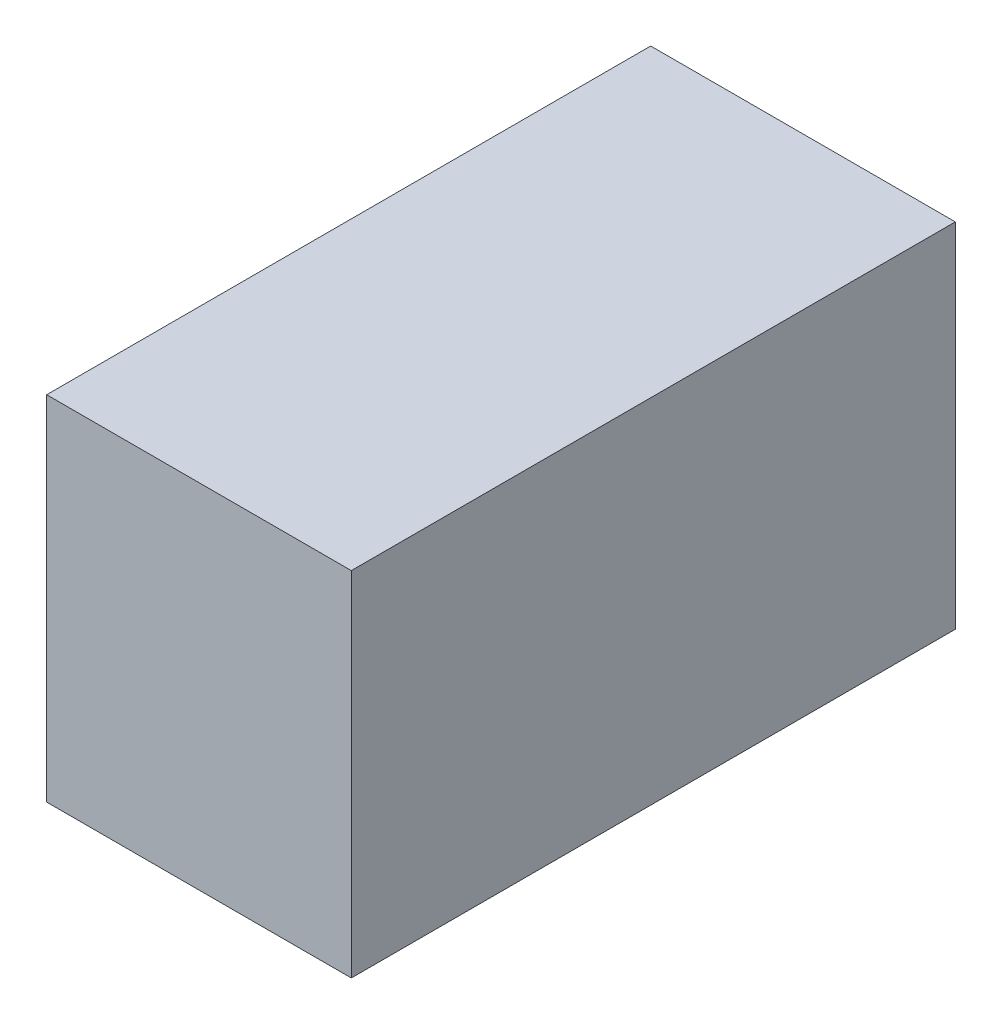
ISO-10303-21;
HEADER;
FILE_DESCRIPTION(('STEP AP214'),'2;1');
FILE_NAME('part.step','',(''),(''),'','','');
FILE_SCHEMA(('AUTOMOTIVE_DESIGN { 1 0 10303 214 1 1 1 1 }'));
ENDSEC;
DATA;
#1=APPLICATION_CONTEXT('core data for automotive mechanical design processes');
#2=APPLICATION_PROTOCOL_DEFINITION('international standard','automotive_design',2000,#1);
#3=PRODUCT_CONTEXT('',#1,'mechanical');
#4=PRODUCT('Part','Part','',(#3));
#5=PRODUCT_RELATED_PRODUCT_CATEGORY('part','',(#4));
#6=PRODUCT_DEFINITION_FORMATION('','',#4);
#7=PRODUCT_DEFINITION_CONTEXT('part definition',#1,'design');
#8=PRODUCT_DEFINITION('design','',#6,#7);
#9=PRODUCT_DEFINITION_SHAPE('','',#8);
#10=(LENGTH_UNIT() NAMED_UNIT(*) SI_UNIT(.MILLI.,.METRE.));
#11=(NAMED_UNIT(*) PLANE_ANGLE_UNIT() SI_UNIT($,.RADIAN.));
#12=(NAMED_UNIT(*) SI_UNIT($,.STERADIAN.) SOLID_ANGLE_UNIT());
#13=UNCERTAINTY_MEASURE_WITH_UNIT(LENGTH_MEASURE(1.E-05),#10,'distance_accuracy_value','');
#14=(GEOMETRIC_REPRESENTATION_CONTEXT(3) GLOBAL_UNCERTAINTY_ASSIGNED_CONTEXT((#13)) GLOBAL_UNIT_ASSIGNED_CONTEXT((#10,
#11,#12)) REPRESENTATION_CONTEXT('',''));
#15=CARTESIAN_POINT('',(0.,0.,0.));
#16=DIRECTION('',(0.,0.,1.));
#17=DIRECTION('',(1.,0.,0.));
#18=AXIS2_PLACEMENT_3D('',#15,#16,#17);
#19=CARTESIAN_POINT('',(-14.6078968253968,14.1813888888889,46.));
#20=DIRECTION('',(1.,0.,0.));
#21=DIRECTION('',(0.,0.,-1.));
#22=AXIS2_PLACEMENT_3D('',#19,#20,#21);
#23=PLANE('',#22);
#24=DIRECTION('',(0.,-1.,0.));
#25=VECTOR('',#24,1.);
#26=CARTESIAN_POINT('',(-14.6078968253968,14.1813888888889,0.));
#27=LINE('',#26,#25);
#28=CARTESIAN_POINT('',(-14.6078968253968,14.1813888888889,0.));
#29=VERTEX_POINT('',#28);
#30=CARTESIAN_POINT('',(-14.6078968253968,-12.6886111111111,0.));
#31=VERTEX_POINT('',#30);
#32=EDGE_CURVE('E101',#29,#31,#27,.T.);
#33=ORIENTED_EDGE('',*,*,#32,.T.);
#34=DIRECTION('',(0.,0.,-1.));
#35=VECTOR('',#34,1.);
#36=CARTESIAN_POINT('',(-14.6078968253968,-12.6886111111111,46.));
#37=LINE('',#36,#35);
#38=CARTESIAN_POINT('',(-14.6078968253968,-12.6886111111111,46.));
#39=VERTEX_POINT('',#38);
#40=EDGE_CURVE('E11',#39,#31,#37,.T.);
#41=ORIENTED_EDGE('',*,*,#40,.F.);
#42=DIRECTION('',(0.,-1.,0.));
#43=VECTOR('',#42,1.);
#44=CARTESIAN_POINT('',(-14.6078968253968,14.1813888888889,46.));
#45=LINE('',#44,#43);
#46=CARTESIAN_POINT('',(-14.6078968253968,14.1813888888889,46.));
#47=VERTEX_POINT('',#46);
#48=EDGE_CURVE('E89',#47,#39,#45,.T.);
#49=ORIENTED_EDGE('',*,*,#48,.F.);
#50=DIRECTION('',(0.,0.,-1.));
#51=VECTOR('',#50,1.);
#52=CARTESIAN_POINT('',(-14.6078968253968,14.1813888888889,46.));
#53=LINE('',#52,#51);
#54=EDGE_CURVE('E97',#47,#29,#53,.T.);
#55=ORIENTED_EDGE('',*,*,#54,.T.);
#56=EDGE_LOOP('',(#33,#41,#49,#55));
#57=FACE_BOUND('',#56,.T.);
#58=ADVANCED_FACE('F38',(#57),#23,.F.);
#59=CARTESIAN_POINT('',(-14.6078968253968,-12.6886111111111,46.));
#60=DIRECTION('',(0.,1.,0.));
#61=DIRECTION('',(0.,0.,1.));
#62=AXIS2_PLACEMENT_3D('',#59,#60,#61);
#63=PLANE('',#62);
#64=DIRECTION('',(1.,0.,0.));
#65=VECTOR('',#64,1.);
#66=CARTESIAN_POINT('',(-14.6078968253968,-12.6886111111111,0.));
#67=LINE('',#66,#65);
#68=CARTESIAN_POINT('',(8.59210317460318,-12.6886111111111,0.));
#69=VERTEX_POINT('',#68);
#70=EDGE_CURVE('E93',#31,#69,#67,.T.);
#71=ORIENTED_EDGE('',*,*,#70,.T.);
#72=DIRECTION('',(0.,0.,-1.));
#73=VECTOR('',#72,1.);
#74=CARTESIAN_POINT('',(8.59210317460318,-12.6886111111111,46.));
#75=LINE('',#74,#73);
#76=CARTESIAN_POINT('',(8.59210317460318,-12.6886111111111,46.));
#77=VERTEX_POINT('',#76);
#78=EDGE_CURVE('E46',#77,#69,#75,.T.);
#79=ORIENTED_EDGE('',*,*,#78,.F.);
#80=DIRECTION('',(1.,0.,0.));
#81=VECTOR('',#80,1.);
#82=CARTESIAN_POINT('',(-14.6078968253968,-12.6886111111111,46.));
#83=LINE('',#82,#81);
#84=EDGE_CURVE('E84',#39,#77,#83,.T.);
#85=ORIENTED_EDGE('',*,*,#84,.F.);
#86=ORIENTED_EDGE('',*,*,#40,.T.);
#87=EDGE_LOOP('',(#71,#79,#85,#86));
#88=FACE_BOUND('',#87,.T.);
#89=ADVANCED_FACE('F92',(#88),#63,.F.);
#90=CARTESIAN_POINT('',(8.59210317460317,14.1813888888889,46.));
#91=DIRECTION('',(-1.,0.,0.));
#92=DIRECTION('',(0.,-1.,0.));
#93=AXIS2_PLACEMENT_3D('',#90,#91,#92);
#94=PLANE('',#93);
#95=DIRECTION('',(0.,1.,0.));
#96=VECTOR('',#95,1.);
#97=CARTESIAN_POINT('',(8.59210317460317,14.1813888888889,0.));
#98=LINE('',#97,#96);
#99=CARTESIAN_POINT('',(8.59210317460317,14.1813888888889,0.));
#100=VERTEX_POINT('',#99);
#101=EDGE_CURVE('E71',#69,#100,#98,.T.);
#102=ORIENTED_EDGE('',*,*,#101,.T.);
#103=DIRECTION('',(0.,0.,-1.));
#104=VECTOR('',#103,1.);
#105=CARTESIAN_POINT('',(8.59210317460317,14.1813888888889,46.));
#106=LINE('',#105,#104);
#107=CARTESIAN_POINT('',(8.59210317460317,14.1813888888889,46.));
#108=VERTEX_POINT('',#107);
#109=EDGE_CURVE('E94',#108,#100,#106,.T.);
#110=ORIENTED_EDGE('',*,*,#109,.F.);
#111=DIRECTION('',(0.,1.,0.));
#112=VECTOR('',#111,1.);
#113=CARTESIAN_POINT('',(8.59210317460317,14.1813888888889,46.));
#114=LINE('',#113,#112);
#115=EDGE_CURVE('E87',#77,#108,#114,.T.);
#116=ORIENTED_EDGE('',*,*,#115,.F.);
#117=ORIENTED_EDGE('',*,*,#78,.T.);
#118=EDGE_LOOP('',(#102,#110,#116,#117));
#119=FACE_BOUND('',#118,.T.);
#120=ADVANCED_FACE('F95',(#119),#94,.F.);
#121=CARTESIAN_POINT('',(-14.6078968253968,14.1813888888889,46.));
#122=DIRECTION('',(0.,-1.,0.));
#123=DIRECTION('',(0.,0.,-1.));
#124=AXIS2_PLACEMENT_3D('',#121,#122,#123);
#125=PLANE('',#124);
#126=DIRECTION('',(-1.,0.,0.));
#127=VECTOR('',#126,1.);
#128=CARTESIAN_POINT('',(-14.6078968253968,14.1813888888889,0.));
#129=LINE('',#128,#127);
#130=EDGE_CURVE('E77',#100,#29,#129,.T.);
#131=ORIENTED_EDGE('',*,*,#130,.T.);
#132=ORIENTED_EDGE('',*,*,#54,.F.);
#133=DIRECTION('',(-1.,0.,0.));
#134=VECTOR('',#133,1.);
#135=CARTESIAN_POINT('',(-14.6078968253968,14.1813888888889,46.));
#136=LINE('',#135,#134);
#137=EDGE_CURVE('E54',#108,#47,#136,.T.);
#138=ORIENTED_EDGE('',*,*,#137,.F.);
#139=ORIENTED_EDGE('',*,*,#109,.T.);
#140=EDGE_LOOP('',(#131,#132,#138,#139));
#141=FACE_BOUND('',#140,.T.);
#142=ADVANCED_FACE('F108',(#141),#125,.F.);
#143=CARTESIAN_POINT('',(0.,0.,46.));
#144=DIRECTION('',(0.,0.,1.));
#145=DIRECTION('',(1.,0.,0.));
#146=AXIS2_PLACEMENT_3D('',#143,#144,#145);
#147=PLANE('',#146);
#148=ORIENTED_EDGE('',*,*,#48,.T.);
#149=ORIENTED_EDGE('',*,*,#84,.T.);
#150=ORIENTED_EDGE('',*,*,#115,.T.);
#151=ORIENTED_EDGE('',*,*,#137,.T.);
#152=EDGE_LOOP('',(#148,#149,#150,#151));
#153=FACE_BOUND('',#152,.T.);
#154=ADVANCED_FACE('F85',(#153),#147,.T.);
#155=CARTESIAN_POINT('',(0.,0.,0.));
#156=DIRECTION('',(0.,0.,1.));
#157=DIRECTION('',(1.,0.,0.));
#158=AXIS2_PLACEMENT_3D('',#155,#156,#157);
#159=PLANE('',#158);
#160=ORIENTED_EDGE('',*,*,#32,.F.);
#161=ORIENTED_EDGE('',*,*,#130,.F.);
#162=ORIENTED_EDGE('',*,*,#101,.F.);
#163=ORIENTED_EDGE('',*,*,#70,.F.);
#164=EDGE_LOOP('',(#160,#161,#162,#163));
#165=FACE_BOUND('',#164,.T.);
#166=ADVANCED_FACE('F111',(#165),#159,.F.);
#167=CLOSED_SHELL('',(#58,#89,#120,#142,#154,#166));
#168=MANIFOLD_SOLID_BREP('B2',#167);
#169=ADVANCED_BREP_SHAPE_REPRESENTATION('',(#18,#168),#14);
#170=SHAPE_DEFINITION_REPRESENTATION(#9,#169);
ENDSEC;
END-ISO-10303-21;
